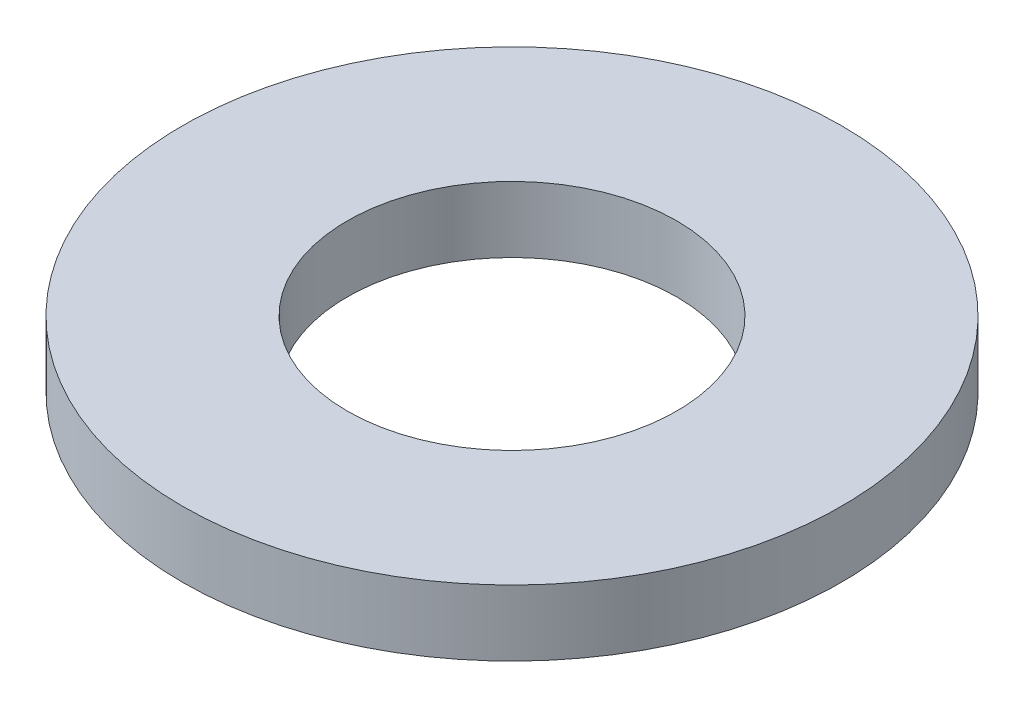
ISO-10303-21;
HEADER;
FILE_DESCRIPTION(('STEP AP214'),'2;1');
FILE_NAME('part.step','',(''),(''),'','','');
FILE_SCHEMA(('AUTOMOTIVE_DESIGN { 1 0 10303 214 1 1 1 1 }'));
ENDSEC;
DATA;
#1=APPLICATION_CONTEXT('core data for automotive mechanical design processes');
#2=APPLICATION_PROTOCOL_DEFINITION('international standard','automotive_design',2000,#1);
#3=PRODUCT_CONTEXT('',#1,'mechanical');
#4=PRODUCT('Part','Part','',(#3));
#5=PRODUCT_RELATED_PRODUCT_CATEGORY('part','',(#4));
#6=PRODUCT_DEFINITION_FORMATION('','',#4);
#7=PRODUCT_DEFINITION_CONTEXT('part definition',#1,'design');
#8=PRODUCT_DEFINITION('design','',#6,#7);
#9=PRODUCT_DEFINITION_SHAPE('','',#8);
#10=(LENGTH_UNIT() NAMED_UNIT(*) SI_UNIT(.MILLI.,.METRE.));
#11=(NAMED_UNIT(*) PLANE_ANGLE_UNIT() SI_UNIT($,.RADIAN.));
#12=(NAMED_UNIT(*) SI_UNIT($,.STERADIAN.) SOLID_ANGLE_UNIT());
#13=UNCERTAINTY_MEASURE_WITH_UNIT(LENGTH_MEASURE(1.E-05),#10,'distance_accuracy_value','');
#14=(GEOMETRIC_REPRESENTATION_CONTEXT(3) GLOBAL_UNCERTAINTY_ASSIGNED_CONTEXT((#13)) GLOBAL_UNIT_ASSIGNED_CONTEXT((#10,
#11,#12)) REPRESENTATION_CONTEXT('',''));
#15=CARTESIAN_POINT('',(0.,0.,0.));
#16=DIRECTION('',(0.,0.,1.));
#17=DIRECTION('',(1.,0.,0.));
#18=AXIS2_PLACEMENT_3D('',#15,#16,#17);
#19=CARTESIAN_POINT('',(0.,12.,0.));
#20=DIRECTION('',(0.,-1.,0.));
#21=DIRECTION('',(0.,0.,-1.));
#22=AXIS2_PLACEMENT_3D('',#19,#20,#21);
#23=CYLINDRICAL_SURFACE('',#22,60.);
#24=CARTESIAN_POINT('',(0.,12.,0.));
#25=DIRECTION('',(0.,1.,0.));
#26=DIRECTION('',(0.,0.,1.));
#27=AXIS2_PLACEMENT_3D('',#24,#25,#26);
#28=CIRCLE('',#27,60.);
#29=CARTESIAN_POINT('',(0.,12.,60.));
#30=VERTEX_POINT('',#29);
#31=EDGE_CURVE('E10',#30,#30,#28,.T.);
#32=ORIENTED_EDGE('',*,*,#31,.F.);
#33=EDGE_LOOP('',(#32));
#34=FACE_BOUND('',#33,.T.);
#35=CARTESIAN_POINT('',(0.,0.,0.));
#36=DIRECTION('',(0.,1.,0.));
#37=DIRECTION('',(0.,0.,1.));
#38=AXIS2_PLACEMENT_3D('',#35,#36,#37);
#39=CIRCLE('',#38,60.);
#40=CARTESIAN_POINT('',(0.,0.,60.));
#41=VERTEX_POINT('',#40);
#42=EDGE_CURVE('E37',#41,#41,#39,.T.);
#43=ORIENTED_EDGE('',*,*,#42,.T.);
#44=EDGE_LOOP('',(#43));
#45=FACE_BOUND('',#44,.T.);
#46=ADVANCED_FACE('F40',(#34,#45),#23,.T.);
#47=CARTESIAN_POINT('',(0.,12.,0.));
#48=DIRECTION('',(0.,1.,0.));
#49=DIRECTION('',(0.,0.,1.));
#50=AXIS2_PLACEMENT_3D('',#47,#48,#49);
#51=PLANE('',#50);
#52=CARTESIAN_POINT('',(0.,12.,0.));
#53=DIRECTION('',(0.,1.,0.));
#54=DIRECTION('',(0.,0.,1.));
#55=AXIS2_PLACEMENT_3D('',#52,#53,#54);
#56=CIRCLE('',#55,30.);
#57=CARTESIAN_POINT('',(0.,12.,30.));
#58=VERTEX_POINT('',#57);
#59=EDGE_CURVE('E50',#58,#58,#56,.T.);
#60=ORIENTED_EDGE('',*,*,#59,.F.);
#61=EDGE_LOOP('',(#60));
#62=FACE_BOUND('',#61,.T.);
#63=ORIENTED_EDGE('',*,*,#31,.T.);
#64=EDGE_LOOP('',(#63));
#65=FACE_BOUND('',#64,.T.);
#66=ADVANCED_FACE('F59',(#62,#65),#51,.T.);
#67=CARTESIAN_POINT('',(0.,0.,0.));
#68=DIRECTION('',(0.,1.,0.));
#69=DIRECTION('',(0.,0.,1.));
#70=AXIS2_PLACEMENT_3D('',#67,#68,#69);
#71=PLANE('',#70);
#72=CARTESIAN_POINT('',(0.,0.,0.));
#73=DIRECTION('',(0.,1.,0.));
#74=DIRECTION('',(0.,0.,1.));
#75=AXIS2_PLACEMENT_3D('',#72,#73,#74);
#76=CIRCLE('',#75,30.);
#77=CARTESIAN_POINT('',(0.,0.,30.));
#78=VERTEX_POINT('',#77);
#79=EDGE_CURVE('E47',#78,#78,#76,.T.);
#80=ORIENTED_EDGE('',*,*,#79,.T.);
#81=EDGE_LOOP('',(#80));
#82=FACE_BOUND('',#81,.T.);
#83=ORIENTED_EDGE('',*,*,#42,.F.);
#84=EDGE_LOOP('',(#83));
#85=FACE_BOUND('',#84,.T.);
#86=ADVANCED_FACE('F58',(#82,#85),#71,.F.);
#87=CARTESIAN_POINT('',(0.,12.,0.));
#88=DIRECTION('',(0.,-1.,0.));
#89=DIRECTION('',(0.,0.,-1.));
#90=AXIS2_PLACEMENT_3D('',#87,#88,#89);
#91=CYLINDRICAL_SURFACE('',#90,30.);
#92=ORIENTED_EDGE('',*,*,#59,.T.);
#93=EDGE_LOOP('',(#92));
#94=FACE_BOUND('',#93,.T.);
#95=ORIENTED_EDGE('',*,*,#79,.F.);
#96=EDGE_LOOP('',(#95));
#97=FACE_BOUND('',#96,.T.);
#98=ADVANCED_FACE('F54',(#94,#97),#91,.F.);
#99=CLOSED_SHELL('',(#46,#66,#86,#98));
#100=MANIFOLD_SOLID_BREP('B2',#99);
#101=ADVANCED_BREP_SHAPE_REPRESENTATION('',(#18,#100),#14);
#102=SHAPE_DEFINITION_REPRESENTATION(#9,#101);
ENDSEC;
END-ISO-10303-21;
